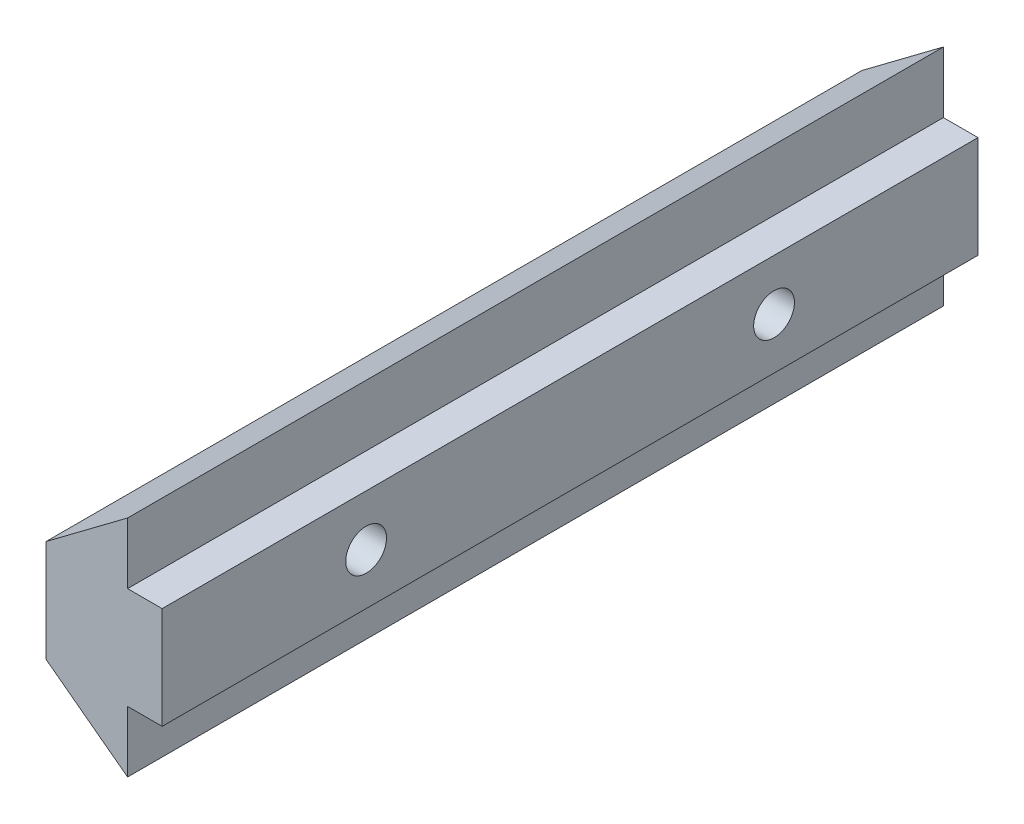
ISO-10303-21;
HEADER;
FILE_DESCRIPTION(('STEP AP214'),'2;1');
FILE_NAME('part.step','',(''),(''),'','','');
FILE_SCHEMA(('AUTOMOTIVE_DESIGN { 1 0 10303 214 1 1 1 1 }'));
ENDSEC;
DATA;
#1=APPLICATION_CONTEXT('core data for automotive mechanical design processes');
#2=APPLICATION_PROTOCOL_DEFINITION('international standard','automotive_design',2000,#1);
#3=PRODUCT_CONTEXT('',#1,'mechanical');
#4=PRODUCT('Part','Part','',(#3));
#5=PRODUCT_RELATED_PRODUCT_CATEGORY('part','',(#4));
#6=PRODUCT_DEFINITION_FORMATION('','',#4);
#7=PRODUCT_DEFINITION_CONTEXT('part definition',#1,'design');
#8=PRODUCT_DEFINITION('design','',#6,#7);
#9=PRODUCT_DEFINITION_SHAPE('','',#8);
#10=(LENGTH_UNIT() NAMED_UNIT(*) SI_UNIT(.MILLI.,.METRE.));
#11=(NAMED_UNIT(*) PLANE_ANGLE_UNIT() SI_UNIT($,.RADIAN.));
#12=(NAMED_UNIT(*) SI_UNIT($,.STERADIAN.) SOLID_ANGLE_UNIT());
#13=UNCERTAINTY_MEASURE_WITH_UNIT(LENGTH_MEASURE(1.E-05),#10,'distance_accuracy_value','');
#14=(GEOMETRIC_REPRESENTATION_CONTEXT(3) GLOBAL_UNCERTAINTY_ASSIGNED_CONTEXT((#13)) GLOBAL_UNIT_ASSIGNED_CONTEXT((#10,
#11,#12)) REPRESENTATION_CONTEXT('',''));
#15=CARTESIAN_POINT('',(0.,0.,0.));
#16=DIRECTION('',(0.,0.,1.));
#17=DIRECTION('',(1.,0.,0.));
#18=AXIS2_PLACEMENT_3D('',#15,#16,#17);
#19=CARTESIAN_POINT('',(0.,0.,40.));
#20=DIRECTION('',(0.6,0.8,0.));
#21=DIRECTION('',(-0.8,0.6,0.));
#22=AXIS2_PLACEMENT_3D('',#19,#20,#21);
#23=PLANE('',#22);
#24=DIRECTION('',(0.8,-0.6,0.));
#25=VECTOR('',#24,1.);
#26=CARTESIAN_POINT('',(0.,0.,0.));
#27=LINE('',#26,#25);
#28=CARTESIAN_POINT('',(0.,0.,0.));
#29=VERTEX_POINT('',#28);
#30=CARTESIAN_POINT('',(4.,-3.,0.));
#31=VERTEX_POINT('',#30);
#32=EDGE_CURVE('E129',#29,#31,#27,.T.);
#33=ORIENTED_EDGE('',*,*,#32,.T.);
#34=DIRECTION('',(0.,0.,-1.));
#35=VECTOR('',#34,1.);
#36=CARTESIAN_POINT('',(4.,-3.,40.));
#37=LINE('',#36,#35);
#38=CARTESIAN_POINT('',(4.,-3.,40.));
#39=VERTEX_POINT('',#38);
#40=EDGE_CURVE('E11',#39,#31,#37,.T.);
#41=ORIENTED_EDGE('',*,*,#40,.F.);
#42=DIRECTION('',(0.8,-0.6,0.));
#43=VECTOR('',#42,1.);
#44=CARTESIAN_POINT('',(0.,0.,40.));
#45=LINE('',#44,#43);
#46=CARTESIAN_POINT('',(0.,0.,40.));
#47=VERTEX_POINT('',#46);
#48=EDGE_CURVE('E144',#47,#39,#45,.T.);
#49=ORIENTED_EDGE('',*,*,#48,.F.);
#50=DIRECTION('',(0.,0.,-1.));
#51=VECTOR('',#50,1.);
#52=CARTESIAN_POINT('',(0.,0.,40.));
#53=LINE('',#52,#51);
#54=EDGE_CURVE('E125',#47,#29,#53,.T.);
#55=ORIENTED_EDGE('',*,*,#54,.T.);
#56=EDGE_LOOP('',(#33,#41,#49,#55));
#57=FACE_BOUND('',#56,.T.);
#58=ADVANCED_FACE('F33',(#57),#23,.F.);
#59=CARTESIAN_POINT('',(4.,0.,40.));
#60=DIRECTION('',(-1.,0.,0.));
#61=DIRECTION('',(0.,0.,1.));
#62=AXIS2_PLACEMENT_3D('',#59,#60,#61);
#63=PLANE('',#62);
#64=DIRECTION('',(0.,1.,0.));
#65=VECTOR('',#64,1.);
#66=CARTESIAN_POINT('',(4.,0.,0.));
#67=LINE('',#66,#65);
#68=CARTESIAN_POINT('',(4.,0.,0.));
#69=VERTEX_POINT('',#68);
#70=EDGE_CURVE('E132',#31,#69,#67,.T.);
#71=ORIENTED_EDGE('',*,*,#70,.T.);
#72=DIRECTION('',(0.,0.,-1.));
#73=VECTOR('',#72,1.);
#74=CARTESIAN_POINT('',(4.,0.,40.));
#75=LINE('',#74,#73);
#76=CARTESIAN_POINT('',(4.,0.,40.));
#77=VERTEX_POINT('',#76);
#78=EDGE_CURVE('E41',#77,#69,#75,.T.);
#79=ORIENTED_EDGE('',*,*,#78,.F.);
#80=DIRECTION('',(0.,1.,0.));
#81=VECTOR('',#80,1.);
#82=CARTESIAN_POINT('',(4.,0.,40.));
#83=LINE('',#82,#81);
#84=EDGE_CURVE('E92',#39,#77,#83,.T.);
#85=ORIENTED_EDGE('',*,*,#84,.F.);
#86=ORIENTED_EDGE('',*,*,#40,.T.);
#87=EDGE_LOOP('',(#71,#79,#85,#86));
#88=FACE_BOUND('',#87,.T.);
#89=ADVANCED_FACE('F214',(#88),#63,.F.);
#90=CARTESIAN_POINT('',(5.69584116590784,0.,40.));
#91=DIRECTION('',(0.,1.,0.));
#92=DIRECTION('',(0.,0.,1.));
#93=AXIS2_PLACEMENT_3D('',#90,#91,#92);
#94=PLANE('',#93);
#95=DIRECTION('',(1.,0.,0.));
#96=VECTOR('',#95,1.);
#97=CARTESIAN_POINT('',(5.69584116590784,0.,0.));
#98=LINE('',#97,#96);
#99=CARTESIAN_POINT('',(5.69584116590784,0.,0.));
#100=VERTEX_POINT('',#99);
#101=EDGE_CURVE('E135',#69,#100,#98,.T.);
#102=ORIENTED_EDGE('',*,*,#101,.T.);
#103=DIRECTION('',(0.,0.,-1.));
#104=VECTOR('',#103,1.);
#105=CARTESIAN_POINT('',(5.69584116590784,0.,40.));
#106=LINE('',#105,#104);
#107=CARTESIAN_POINT('',(5.69584116590784,0.,40.));
#108=VERTEX_POINT('',#107);
#109=EDGE_CURVE('E151',#108,#100,#106,.T.);
#110=ORIENTED_EDGE('',*,*,#109,.F.);
#111=DIRECTION('',(1.,0.,0.));
#112=VECTOR('',#111,1.);
#113=CARTESIAN_POINT('',(5.69584116590784,0.,40.));
#114=LINE('',#113,#112);
#115=EDGE_CURVE('E159',#77,#108,#114,.T.);
#116=ORIENTED_EDGE('',*,*,#115,.F.);
#117=ORIENTED_EDGE('',*,*,#78,.T.);
#118=EDGE_LOOP('',(#102,#110,#116,#117));
#119=FACE_BOUND('',#118,.T.);
#120=ADVANCED_FACE('F157',(#119),#94,.F.);
#121=CARTESIAN_POINT('',(5.69584116590784,5.,40.));
#122=DIRECTION('',(-1.,0.,0.));
#123=DIRECTION('',(0.,0.,1.));
#124=AXIS2_PLACEMENT_3D('',#121,#122,#123);
#125=PLANE('',#124);
#126=CARTESIAN_POINT('',(5.69584116590784,2.5,10.));
#127=DIRECTION('',(1.,0.,0.));
#128=DIRECTION('',(0.,0.,-1.));
#129=AXIS2_PLACEMENT_3D('',#126,#127,#128);
#130=CIRCLE('',#129,1.);
#131=CARTESIAN_POINT('',(5.69584116590784,2.5,9.));
#132=VERTEX_POINT('',#131);
#133=EDGE_CURVE('E183',#132,#132,#130,.T.);
#134=ORIENTED_EDGE('',*,*,#133,.F.);
#135=EDGE_LOOP('',(#134));
#136=FACE_BOUND('',#135,.T.);
#137=CARTESIAN_POINT('',(5.69584116590784,2.5,30.));
#138=DIRECTION('',(1.,0.,0.));
#139=DIRECTION('',(0.,0.,-1.));
#140=AXIS2_PLACEMENT_3D('',#137,#138,#139);
#141=CIRCLE('',#140,1.);
#142=CARTESIAN_POINT('',(5.69584116590784,2.5,29.));
#143=VERTEX_POINT('',#142);
#144=EDGE_CURVE('E177',#143,#143,#141,.T.);
#145=ORIENTED_EDGE('',*,*,#144,.F.);
#146=EDGE_LOOP('',(#145));
#147=FACE_BOUND('',#146,.T.);
#148=DIRECTION('',(0.,1.,0.));
#149=VECTOR('',#148,1.);
#150=CARTESIAN_POINT('',(5.69584116590784,5.,0.));
#151=LINE('',#150,#149);
#152=CARTESIAN_POINT('',(5.69584116590784,5.,0.));
#153=VERTEX_POINT('',#152);
#154=EDGE_CURVE('E137',#100,#153,#151,.T.);
#155=ORIENTED_EDGE('',*,*,#154,.T.);
#156=DIRECTION('',(0.,0.,-1.));
#157=VECTOR('',#156,1.);
#158=CARTESIAN_POINT('',(5.69584116590784,5.,40.));
#159=LINE('',#158,#157);
#160=CARTESIAN_POINT('',(5.69584116590784,5.,40.));
#161=VERTEX_POINT('',#160);
#162=EDGE_CURVE('E148',#161,#153,#159,.T.);
#163=ORIENTED_EDGE('',*,*,#162,.F.);
#164=DIRECTION('',(0.,1.,0.));
#165=VECTOR('',#164,1.);
#166=CARTESIAN_POINT('',(5.69584116590784,5.,40.));
#167=LINE('',#166,#165);
#168=EDGE_CURVE('E171',#108,#161,#167,.T.);
#169=ORIENTED_EDGE('',*,*,#168,.F.);
#170=ORIENTED_EDGE('',*,*,#109,.T.);
#171=EDGE_LOOP('',(#155,#163,#169,#170));
#172=FACE_BOUND('',#171,.T.);
#173=ADVANCED_FACE('F167',(#136,#147,#172),#125,.F.);
#174=CARTESIAN_POINT('',(4.,5.,40.));
#175=DIRECTION('',(0.,-1.,0.));
#176=DIRECTION('',(0.,0.,-1.));
#177=AXIS2_PLACEMENT_3D('',#174,#175,#176);
#178=PLANE('',#177);
#179=DIRECTION('',(-1.,0.,0.));
#180=VECTOR('',#179,1.);
#181=CARTESIAN_POINT('',(4.,5.,0.));
#182=LINE('',#181,#180);
#183=CARTESIAN_POINT('',(4.,5.,0.));
#184=VERTEX_POINT('',#183);
#185=EDGE_CURVE('E139',#153,#184,#182,.T.);
#186=ORIENTED_EDGE('',*,*,#185,.T.);
#187=DIRECTION('',(0.,0.,-1.));
#188=VECTOR('',#187,1.);
#189=CARTESIAN_POINT('',(4.,5.,40.));
#190=LINE('',#189,#188);
#191=CARTESIAN_POINT('',(4.,5.,40.));
#192=VERTEX_POINT('',#191);
#193=EDGE_CURVE('E120',#192,#184,#190,.T.);
#194=ORIENTED_EDGE('',*,*,#193,.F.);
#195=DIRECTION('',(-1.,0.,0.));
#196=VECTOR('',#195,1.);
#197=CARTESIAN_POINT('',(4.,5.,40.));
#198=LINE('',#197,#196);
#199=EDGE_CURVE('E111',#161,#192,#198,.T.);
#200=ORIENTED_EDGE('',*,*,#199,.F.);
#201=ORIENTED_EDGE('',*,*,#162,.T.);
#202=EDGE_LOOP('',(#186,#194,#200,#201));
#203=FACE_BOUND('',#202,.T.);
#204=ADVANCED_FACE('F170',(#203),#178,.F.);
#205=CARTESIAN_POINT('',(4.,8.,40.));
#206=DIRECTION('',(-1.,0.,0.));
#207=DIRECTION('',(0.,0.,1.));
#208=AXIS2_PLACEMENT_3D('',#205,#206,#207);
#209=PLANE('',#208);
#210=DIRECTION('',(0.,1.,0.));
#211=VECTOR('',#210,1.);
#212=CARTESIAN_POINT('',(4.,8.,0.));
#213=LINE('',#212,#211);
#214=CARTESIAN_POINT('',(4.,8.,0.));
#215=VERTEX_POINT('',#214);
#216=EDGE_CURVE('E119',#184,#215,#213,.T.);
#217=ORIENTED_EDGE('',*,*,#216,.T.);
#218=DIRECTION('',(0.,0.,-1.));
#219=VECTOR('',#218,1.);
#220=CARTESIAN_POINT('',(4.,8.,40.));
#221=LINE('',#220,#219);
#222=CARTESIAN_POINT('',(4.,8.,40.));
#223=VERTEX_POINT('',#222);
#224=EDGE_CURVE('E116',#223,#215,#221,.T.);
#225=ORIENTED_EDGE('',*,*,#224,.F.);
#226=DIRECTION('',(0.,1.,0.));
#227=VECTOR('',#226,1.);
#228=CARTESIAN_POINT('',(4.,8.,40.));
#229=LINE('',#228,#227);
#230=EDGE_CURVE('E105',#192,#223,#229,.T.);
#231=ORIENTED_EDGE('',*,*,#230,.F.);
#232=ORIENTED_EDGE('',*,*,#193,.T.);
#233=EDGE_LOOP('',(#217,#225,#231,#232));
#234=FACE_BOUND('',#233,.T.);
#235=ADVANCED_FACE('F117',(#234),#209,.F.);
#236=CARTESIAN_POINT('',(0.,5.,40.));
#237=DIRECTION('',(0.6,-0.8,0.));
#238=DIRECTION('',(0.8,0.6,0.));
#239=AXIS2_PLACEMENT_3D('',#236,#237,#238);
#240=PLANE('',#239);
#241=DIRECTION('',(-0.8,-0.6,0.));
#242=VECTOR('',#241,1.);
#243=CARTESIAN_POINT('',(0.,5.,0.));
#244=LINE('',#243,#242);
#245=CARTESIAN_POINT('',(0.,5.,0.));
#246=VERTEX_POINT('',#245);
#247=EDGE_CURVE('E78',#215,#246,#244,.T.);
#248=ORIENTED_EDGE('',*,*,#247,.T.);
#249=DIRECTION('',(0.,0.,-1.));
#250=VECTOR('',#249,1.);
#251=CARTESIAN_POINT('',(0.,5.,40.));
#252=LINE('',#251,#250);
#253=CARTESIAN_POINT('',(0.,5.,40.));
#254=VERTEX_POINT('',#253);
#255=EDGE_CURVE('E121',#254,#246,#252,.T.);
#256=ORIENTED_EDGE('',*,*,#255,.F.);
#257=DIRECTION('',(-0.8,-0.6,0.));
#258=VECTOR('',#257,1.);
#259=CARTESIAN_POINT('',(0.,5.,40.));
#260=LINE('',#259,#258);
#261=EDGE_CURVE('E109',#223,#254,#260,.T.);
#262=ORIENTED_EDGE('',*,*,#261,.F.);
#263=ORIENTED_EDGE('',*,*,#224,.T.);
#264=EDGE_LOOP('',(#248,#256,#262,#263));
#265=FACE_BOUND('',#264,.T.);
#266=ADVANCED_FACE('F123',(#265),#240,.F.);
#267=CARTESIAN_POINT('',(0.,0.,40.));
#268=DIRECTION('',(1.,0.,0.));
#269=DIRECTION('',(0.,0.,-1.));
#270=AXIS2_PLACEMENT_3D('',#267,#268,#269);
#271=PLANE('',#270);
#272=CARTESIAN_POINT('',(0.,2.5,10.));
#273=DIRECTION('',(1.,0.,0.));
#274=DIRECTION('',(0.,0.,-1.));
#275=AXIS2_PLACEMENT_3D('',#272,#273,#274);
#276=CIRCLE('',#275,1.);
#277=CARTESIAN_POINT('',(0.,2.5,9.));
#278=VERTEX_POINT('',#277);
#279=EDGE_CURVE('E180',#278,#278,#276,.T.);
#280=ORIENTED_EDGE('',*,*,#279,.T.);
#281=EDGE_LOOP('',(#280));
#282=FACE_BOUND('',#281,.T.);
#283=CARTESIAN_POINT('',(0.,2.5,30.));
#284=DIRECTION('',(1.,0.,0.));
#285=DIRECTION('',(0.,0.,-1.));
#286=AXIS2_PLACEMENT_3D('',#283,#284,#285);
#287=CIRCLE('',#286,1.);
#288=CARTESIAN_POINT('',(0.,2.5,29.));
#289=VERTEX_POINT('',#288);
#290=EDGE_CURVE('E133',#289,#289,#287,.T.);
#291=ORIENTED_EDGE('',*,*,#290,.T.);
#292=EDGE_LOOP('',(#291));
#293=FACE_BOUND('',#292,.T.);
#294=DIRECTION('',(0.,-1.,0.));
#295=VECTOR('',#294,1.);
#296=CARTESIAN_POINT('',(0.,0.,0.));
#297=LINE('',#296,#295);
#298=EDGE_CURVE('E84',#246,#29,#297,.T.);
#299=ORIENTED_EDGE('',*,*,#298,.T.);
#300=ORIENTED_EDGE('',*,*,#54,.F.);
#301=DIRECTION('',(0.,-1.,0.));
#302=VECTOR('',#301,1.);
#303=CARTESIAN_POINT('',(0.,0.,40.));
#304=LINE('',#303,#302);
#305=EDGE_CURVE('E49',#254,#47,#304,.T.);
#306=ORIENTED_EDGE('',*,*,#305,.F.);
#307=ORIENTED_EDGE('',*,*,#255,.T.);
#308=EDGE_LOOP('',(#299,#300,#306,#307));
#309=FACE_BOUND('',#308,.T.);
#310=ADVANCED_FACE('F189',(#282,#293,#309),#271,.F.);
#311=CARTESIAN_POINT('',(0.,0.,40.));
#312=DIRECTION('',(0.,0.,1.));
#313=DIRECTION('',(1.,0.,0.));
#314=AXIS2_PLACEMENT_3D('',#311,#312,#313);
#315=PLANE('',#314);
#316=ORIENTED_EDGE('',*,*,#48,.T.);
#317=ORIENTED_EDGE('',*,*,#84,.T.);
#318=ORIENTED_EDGE('',*,*,#115,.T.);
#319=ORIENTED_EDGE('',*,*,#168,.T.);
#320=ORIENTED_EDGE('',*,*,#199,.T.);
#321=ORIENTED_EDGE('',*,*,#230,.T.);
#322=ORIENTED_EDGE('',*,*,#261,.T.);
#323=ORIENTED_EDGE('',*,*,#305,.T.);
#324=EDGE_LOOP('',(#316,#317,#318,#319,#320,#321,#322,#323));
#325=FACE_BOUND('',#324,.T.);
#326=ADVANCED_FACE('F107',(#325),#315,.T.);
#327=CARTESIAN_POINT('',(0.,0.,0.));
#328=DIRECTION('',(0.,0.,1.));
#329=DIRECTION('',(1.,0.,0.));
#330=AXIS2_PLACEMENT_3D('',#327,#328,#329);
#331=PLANE('',#330);
#332=ORIENTED_EDGE('',*,*,#32,.F.);
#333=ORIENTED_EDGE('',*,*,#298,.F.);
#334=ORIENTED_EDGE('',*,*,#247,.F.);
#335=ORIENTED_EDGE('',*,*,#216,.F.);
#336=ORIENTED_EDGE('',*,*,#185,.F.);
#337=ORIENTED_EDGE('',*,*,#154,.F.);
#338=ORIENTED_EDGE('',*,*,#101,.F.);
#339=ORIENTED_EDGE('',*,*,#70,.F.);
#340=EDGE_LOOP('',(#332,#333,#334,#335,#336,#337,#338,#339));
#341=FACE_BOUND('',#340,.T.);
#342=ADVANCED_FACE('F163',(#341),#331,.F.);
#343=CARTESIAN_POINT('',(0.,2.5,30.));
#344=DIRECTION('',(1.,0.,0.));
#345=DIRECTION('',(0.,0.,-1.));
#346=AXIS2_PLACEMENT_3D('',#343,#344,#345);
#347=CYLINDRICAL_SURFACE('',#346,1.);
#348=ORIENTED_EDGE('',*,*,#290,.F.);
#349=EDGE_LOOP('',(#348));
#350=FACE_BOUND('',#349,.T.);
#351=ORIENTED_EDGE('',*,*,#144,.T.);
#352=EDGE_LOOP('',(#351));
#353=FACE_BOUND('',#352,.T.);
#354=ADVANCED_FACE('F195',(#350,#353),#347,.F.);
#355=CARTESIAN_POINT('',(0.,2.5,10.));
#356=DIRECTION('',(1.,0.,0.));
#357=DIRECTION('',(0.,0.,-1.));
#358=AXIS2_PLACEMENT_3D('',#355,#356,#357);
#359=CYLINDRICAL_SURFACE('',#358,1.);
#360=ORIENTED_EDGE('',*,*,#279,.F.);
#361=EDGE_LOOP('',(#360));
#362=FACE_BOUND('',#361,.T.);
#363=ORIENTED_EDGE('',*,*,#133,.T.);
#364=EDGE_LOOP('',(#363));
#365=FACE_BOUND('',#364,.T.);
#366=ADVANCED_FACE('F192',(#362,#365),#359,.F.);
#367=CLOSED_SHELL('',(#58,#89,#120,#173,#204,#235,#266,#310,#326,#342,#354,#366));
#368=MANIFOLD_SOLID_BREP('B2',#367);
#369=ADVANCED_BREP_SHAPE_REPRESENTATION('',(#18,#368),#14);
#370=SHAPE_DEFINITION_REPRESENTATION(#9,#369);
ENDSEC;
END-ISO-10303-21;
